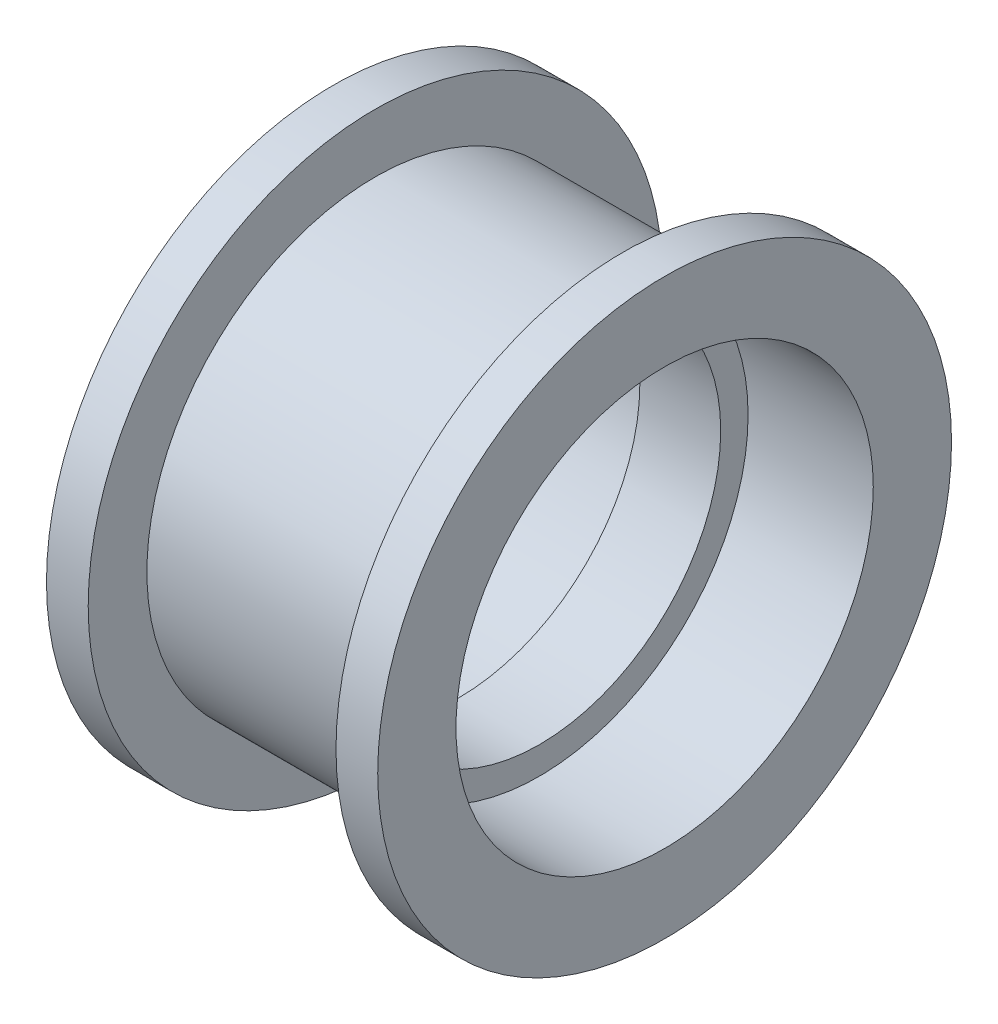
ISO-10303-21;
HEADER;
FILE_DESCRIPTION(('STEP AP214'),'2;1');
FILE_NAME('part.step','',(''),(''),'','','');
FILE_SCHEMA(('AUTOMOTIVE_DESIGN { 1 0 10303 214 1 1 1 1 }'));
ENDSEC;
DATA;
#1=APPLICATION_CONTEXT('core data for automotive mechanical design processes');
#2=APPLICATION_PROTOCOL_DEFINITION('international standard','automotive_design',2000,#1);
#3=PRODUCT_CONTEXT('',#1,'mechanical');
#4=PRODUCT('Part','Part','',(#3));
#5=PRODUCT_RELATED_PRODUCT_CATEGORY('part','',(#4));
#6=PRODUCT_DEFINITION_FORMATION('','',#4);
#7=PRODUCT_DEFINITION_CONTEXT('part definition',#1,'design');
#8=PRODUCT_DEFINITION('design','',#6,#7);
#9=PRODUCT_DEFINITION_SHAPE('','',#8);
#10=(LENGTH_UNIT() NAMED_UNIT(*) SI_UNIT(.MILLI.,.METRE.));
#11=(NAMED_UNIT(*) PLANE_ANGLE_UNIT() SI_UNIT($,.RADIAN.));
#12=(NAMED_UNIT(*) SI_UNIT($,.STERADIAN.) SOLID_ANGLE_UNIT());
#13=UNCERTAINTY_MEASURE_WITH_UNIT(LENGTH_MEASURE(1.E-05),#10,'distance_accuracy_value','');
#14=(GEOMETRIC_REPRESENTATION_CONTEXT(3) GLOBAL_UNCERTAINTY_ASSIGNED_CONTEXT((#13)) GLOBAL_UNIT_ASSIGNED_CONTEXT((#10,
#11,#12)) REPRESENTATION_CONTEXT('',''));
#15=CARTESIAN_POINT('',(0.,0.,0.));
#16=DIRECTION('',(0.,0.,1.));
#17=DIRECTION('',(1.,0.,0.));
#18=AXIS2_PLACEMENT_3D('',#15,#16,#17);
#19=CARTESIAN_POINT('',(-1.55,6.95,0.));
#20=DIRECTION('',(-1.,0.,0.));
#21=DIRECTION('',(0.,0.,1.));
#22=AXIS2_PLACEMENT_3D('',#19,#20,#21);
#23=PLANE('',#22);
#24=CARTESIAN_POINT('',(-1.55,0.,0.));
#25=DIRECTION('',(1.,0.,0.));
#26=DIRECTION('',(0.,0.,-1.));
#27=AXIS2_PLACEMENT_3D('',#24,#25,#26);
#28=CIRCLE('',#27,6.95);
#29=CARTESIAN_POINT('',(-1.55,0.,-6.95));
#30=VERTEX_POINT('',#29);
#31=EDGE_CURVE('E10',#30,#30,#28,.T.);
#32=ORIENTED_EDGE('',*,*,#31,.T.);
#33=EDGE_LOOP('',(#32));
#34=FACE_BOUND('',#33,.T.);
#35=CARTESIAN_POINT('',(-1.55,0.,0.));
#36=DIRECTION('',(1.,0.,0.));
#37=DIRECTION('',(0.,0.,-1.));
#38=AXIS2_PLACEMENT_3D('',#35,#36,#37);
#39=CIRCLE('',#38,8.);
#40=CARTESIAN_POINT('',(-1.55,0.,-8.));
#41=VERTEX_POINT('',#40);
#42=EDGE_CURVE('E74',#41,#41,#39,.T.);
#43=ORIENTED_EDGE('',*,*,#42,.F.);
#44=EDGE_LOOP('',(#43));
#45=FACE_BOUND('',#44,.T.);
#46=ADVANCED_FACE('F32',(#34,#45),#23,.T.);
#47=CARTESIAN_POINT('',(0.,0.,0.));
#48=DIRECTION('',(1.,0.,0.));
#49=DIRECTION('',(0.,0.,-1.));
#50=AXIS2_PLACEMENT_3D('',#47,#48,#49);
#51=CYLINDRICAL_SURFACE('',#50,6.95);
#52=CARTESIAN_POINT('',(1.55,0.,0.));
#53=DIRECTION('',(1.,0.,0.));
#54=DIRECTION('',(0.,0.,-1.));
#55=AXIS2_PLACEMENT_3D('',#52,#53,#54);
#56=CIRCLE('',#55,6.95);
#57=CARTESIAN_POINT('',(1.55,0.,-6.95));
#58=VERTEX_POINT('',#57);
#59=EDGE_CURVE('E38',#58,#58,#56,.T.);
#60=ORIENTED_EDGE('',*,*,#59,.T.);
#61=EDGE_LOOP('',(#60));
#62=FACE_BOUND('',#61,.T.);
#63=ORIENTED_EDGE('',*,*,#31,.F.);
#64=EDGE_LOOP('',(#63));
#65=FACE_BOUND('',#64,.T.);
#66=ADVANCED_FACE('F82',(#62,#65),#51,.F.);
#67=CARTESIAN_POINT('',(1.55,6.95,0.));
#68=DIRECTION('',(1.,0.,0.));
#69=DIRECTION('',(0.,0.,-1.));
#70=AXIS2_PLACEMENT_3D('',#67,#68,#69);
#71=PLANE('',#70);
#72=CARTESIAN_POINT('',(1.55,0.,0.));
#73=DIRECTION('',(1.,0.,0.));
#74=DIRECTION('',(0.,0.,-1.));
#75=AXIS2_PLACEMENT_3D('',#72,#73,#74);
#76=CIRCLE('',#75,8.);
#77=CARTESIAN_POINT('',(1.55,0.,-8.));
#78=VERTEX_POINT('',#77);
#79=EDGE_CURVE('E42',#78,#78,#76,.T.);
#80=ORIENTED_EDGE('',*,*,#79,.T.);
#81=EDGE_LOOP('',(#80));
#82=FACE_BOUND('',#81,.T.);
#83=ORIENTED_EDGE('',*,*,#59,.F.);
#84=EDGE_LOOP('',(#83));
#85=FACE_BOUND('',#84,.T.);
#86=ADVANCED_FACE('F86',(#82,#85),#71,.T.);
#87=CARTESIAN_POINT('',(0.,0.,0.));
#88=DIRECTION('',(1.,0.,0.));
#89=DIRECTION('',(0.,0.,-1.));
#90=AXIS2_PLACEMENT_3D('',#87,#88,#89);
#91=CYLINDRICAL_SURFACE('',#90,8.);
#92=CARTESIAN_POINT('',(6.35,0.,0.));
#93=DIRECTION('',(1.,0.,0.));
#94=DIRECTION('',(0.,0.,-1.));
#95=AXIS2_PLACEMENT_3D('',#92,#93,#94);
#96=CIRCLE('',#95,8.);
#97=CARTESIAN_POINT('',(6.35,0.,-8.));
#98=VERTEX_POINT('',#97);
#99=EDGE_CURVE('E46',#98,#98,#96,.T.);
#100=ORIENTED_EDGE('',*,*,#99,.T.);
#101=EDGE_LOOP('',(#100));
#102=FACE_BOUND('',#101,.T.);
#103=ORIENTED_EDGE('',*,*,#79,.F.);
#104=EDGE_LOOP('',(#103));
#105=FACE_BOUND('',#104,.T.);
#106=ADVANCED_FACE('F90',(#102,#105),#91,.F.);
#107=CARTESIAN_POINT('',(6.35,8.,0.));
#108=DIRECTION('',(1.,0.,0.));
#109=DIRECTION('',(0.,0.,-1.));
#110=AXIS2_PLACEMENT_3D('',#107,#108,#109);
#111=PLANE('',#110);
#112=CARTESIAN_POINT('',(6.35,0.,0.));
#113=DIRECTION('',(1.,0.,0.));
#114=DIRECTION('',(0.,0.,-1.));
#115=AXIS2_PLACEMENT_3D('',#112,#113,#114);
#116=CIRCLE('',#115,11.);
#117=CARTESIAN_POINT('',(6.35,0.,-11.));
#118=VERTEX_POINT('',#117);
#119=EDGE_CURVE('E51',#118,#118,#116,.T.);
#120=ORIENTED_EDGE('',*,*,#119,.T.);
#121=EDGE_LOOP('',(#120));
#122=FACE_BOUND('',#121,.T.);
#123=ORIENTED_EDGE('',*,*,#99,.F.);
#124=EDGE_LOOP('',(#123));
#125=FACE_BOUND('',#124,.T.);
#126=ADVANCED_FACE('F97',(#122,#125),#111,.T.);
#127=CARTESIAN_POINT('',(0.,0.,0.));
#128=DIRECTION('',(1.,0.,0.));
#129=DIRECTION('',(0.,0.,-1.));
#130=AXIS2_PLACEMENT_3D('',#127,#128,#129);
#131=CYLINDRICAL_SURFACE('',#130,11.);
#132=CARTESIAN_POINT('',(4.75,0.,0.));
#133=DIRECTION('',(1.,0.,0.));
#134=DIRECTION('',(0.,0.,-1.));
#135=AXIS2_PLACEMENT_3D('',#132,#133,#134);
#136=CIRCLE('',#135,11.);
#137=CARTESIAN_POINT('',(4.75,0.,-11.));
#138=VERTEX_POINT('',#137);
#139=EDGE_CURVE('E54',#138,#138,#136,.T.);
#140=ORIENTED_EDGE('',*,*,#139,.T.);
#141=EDGE_LOOP('',(#140));
#142=FACE_BOUND('',#141,.T.);
#143=ORIENTED_EDGE('',*,*,#119,.F.);
#144=EDGE_LOOP('',(#143));
#145=FACE_BOUND('',#144,.T.);
#146=ADVANCED_FACE('F101',(#142,#145),#131,.T.);
#147=CARTESIAN_POINT('',(4.75,11.,0.));
#148=DIRECTION('',(-1.,0.,0.));
#149=DIRECTION('',(0.,0.,1.));
#150=AXIS2_PLACEMENT_3D('',#147,#148,#149);
#151=PLANE('',#150);
#152=CARTESIAN_POINT('',(4.75,0.,0.));
#153=DIRECTION('',(1.,0.,0.));
#154=DIRECTION('',(0.,0.,-1.));
#155=AXIS2_PLACEMENT_3D('',#152,#153,#154);
#156=CIRCLE('',#155,8.75);
#157=CARTESIAN_POINT('',(4.75,0.,-8.75));
#158=VERTEX_POINT('',#157);
#159=EDGE_CURVE('E57',#158,#158,#156,.T.);
#160=ORIENTED_EDGE('',*,*,#159,.T.);
#161=EDGE_LOOP('',(#160));
#162=FACE_BOUND('',#161,.T.);
#163=ORIENTED_EDGE('',*,*,#139,.F.);
#164=EDGE_LOOP('',(#163));
#165=FACE_BOUND('',#164,.T.);
#166=ADVANCED_FACE('F105',(#162,#165),#151,.T.);
#167=CARTESIAN_POINT('',(0.,0.,0.));
#168=DIRECTION('',(1.,0.,0.));
#169=DIRECTION('',(0.,0.,-1.));
#170=AXIS2_PLACEMENT_3D('',#167,#168,#169);
#171=CYLINDRICAL_SURFACE('',#170,8.75);
#172=CARTESIAN_POINT('',(-4.75,0.,0.));
#173=DIRECTION('',(1.,0.,0.));
#174=DIRECTION('',(0.,0.,-1.));
#175=AXIS2_PLACEMENT_3D('',#172,#173,#174);
#176=CIRCLE('',#175,8.75);
#177=CARTESIAN_POINT('',(-4.75,0.,-8.75));
#178=VERTEX_POINT('',#177);
#179=EDGE_CURVE('E61',#178,#178,#176,.T.);
#180=ORIENTED_EDGE('',*,*,#179,.T.);
#181=EDGE_LOOP('',(#180));
#182=FACE_BOUND('',#181,.T.);
#183=ORIENTED_EDGE('',*,*,#159,.F.);
#184=EDGE_LOOP('',(#183));
#185=FACE_BOUND('',#184,.T.);
#186=ADVANCED_FACE('F109',(#182,#185),#171,.T.);
#187=CARTESIAN_POINT('',(-4.75,11.,0.));
#188=DIRECTION('',(1.,0.,0.));
#189=DIRECTION('',(0.,0.,-1.));
#190=AXIS2_PLACEMENT_3D('',#187,#188,#189);
#191=PLANE('',#190);
#192=CARTESIAN_POINT('',(-4.75,0.,0.));
#193=DIRECTION('',(1.,0.,0.));
#194=DIRECTION('',(0.,0.,-1.));
#195=AXIS2_PLACEMENT_3D('',#192,#193,#194);
#196=CIRCLE('',#195,11.);
#197=CARTESIAN_POINT('',(-4.75,0.,-11.));
#198=VERTEX_POINT('',#197);
#199=EDGE_CURVE('E65',#198,#198,#196,.T.);
#200=ORIENTED_EDGE('',*,*,#199,.T.);
#201=EDGE_LOOP('',(#200));
#202=FACE_BOUND('',#201,.T.);
#203=ORIENTED_EDGE('',*,*,#179,.F.);
#204=EDGE_LOOP('',(#203));
#205=FACE_BOUND('',#204,.T.);
#206=ADVANCED_FACE('F113',(#202,#205),#191,.T.);
#207=CARTESIAN_POINT('',(0.,0.,0.));
#208=DIRECTION('',(1.,0.,0.));
#209=DIRECTION('',(0.,0.,-1.));
#210=AXIS2_PLACEMENT_3D('',#207,#208,#209);
#211=CYLINDRICAL_SURFACE('',#210,11.);
#212=CARTESIAN_POINT('',(-6.35,0.,0.));
#213=DIRECTION('',(1.,0.,0.));
#214=DIRECTION('',(0.,0.,-1.));
#215=AXIS2_PLACEMENT_3D('',#212,#213,#214);
#216=CIRCLE('',#215,11.);
#217=CARTESIAN_POINT('',(-6.35,0.,-11.));
#218=VERTEX_POINT('',#217);
#219=EDGE_CURVE('E68',#218,#218,#216,.T.);
#220=ORIENTED_EDGE('',*,*,#219,.T.);
#221=EDGE_LOOP('',(#220));
#222=FACE_BOUND('',#221,.T.);
#223=ORIENTED_EDGE('',*,*,#199,.F.);
#224=EDGE_LOOP('',(#223));
#225=FACE_BOUND('',#224,.T.);
#226=ADVANCED_FACE('F117',(#222,#225),#211,.T.);
#227=CARTESIAN_POINT('',(-6.35,8.,0.));
#228=DIRECTION('',(-1.,0.,0.));
#229=DIRECTION('',(0.,0.,1.));
#230=AXIS2_PLACEMENT_3D('',#227,#228,#229);
#231=PLANE('',#230);
#232=CARTESIAN_POINT('',(-6.35,0.,0.));
#233=DIRECTION('',(1.,0.,0.));
#234=DIRECTION('',(0.,0.,-1.));
#235=AXIS2_PLACEMENT_3D('',#232,#233,#234);
#236=CIRCLE('',#235,8.);
#237=CARTESIAN_POINT('',(-6.35,0.,-8.));
#238=VERTEX_POINT('',#237);
#239=EDGE_CURVE('E71',#238,#238,#236,.T.);
#240=ORIENTED_EDGE('',*,*,#239,.T.);
#241=EDGE_LOOP('',(#240));
#242=FACE_BOUND('',#241,.T.);
#243=ORIENTED_EDGE('',*,*,#219,.F.);
#244=EDGE_LOOP('',(#243));
#245=FACE_BOUND('',#244,.T.);
#246=ADVANCED_FACE('F121',(#242,#245),#231,.T.);
#247=CARTESIAN_POINT('',(0.,0.,0.));
#248=DIRECTION('',(1.,0.,0.));
#249=DIRECTION('',(0.,0.,-1.));
#250=AXIS2_PLACEMENT_3D('',#247,#248,#249);
#251=CYLINDRICAL_SURFACE('',#250,8.);
#252=ORIENTED_EDGE('',*,*,#42,.T.);
#253=EDGE_LOOP('',(#252));
#254=FACE_BOUND('',#253,.T.);
#255=ORIENTED_EDGE('',*,*,#239,.F.);
#256=EDGE_LOOP('',(#255));
#257=FACE_BOUND('',#256,.T.);
#258=ADVANCED_FACE('F78',(#254,#257),#251,.F.);
#259=CLOSED_SHELL('',(#46,#66,#86,#106,#126,#146,#166,#186,#206,#226,#246,#258));
#260=MANIFOLD_SOLID_BREP('B2',#259);
#261=ADVANCED_BREP_SHAPE_REPRESENTATION('',(#18,#260),#14);
#262=SHAPE_DEFINITION_REPRESENTATION(#9,#261);
ENDSEC;
END-ISO-10303-21;
